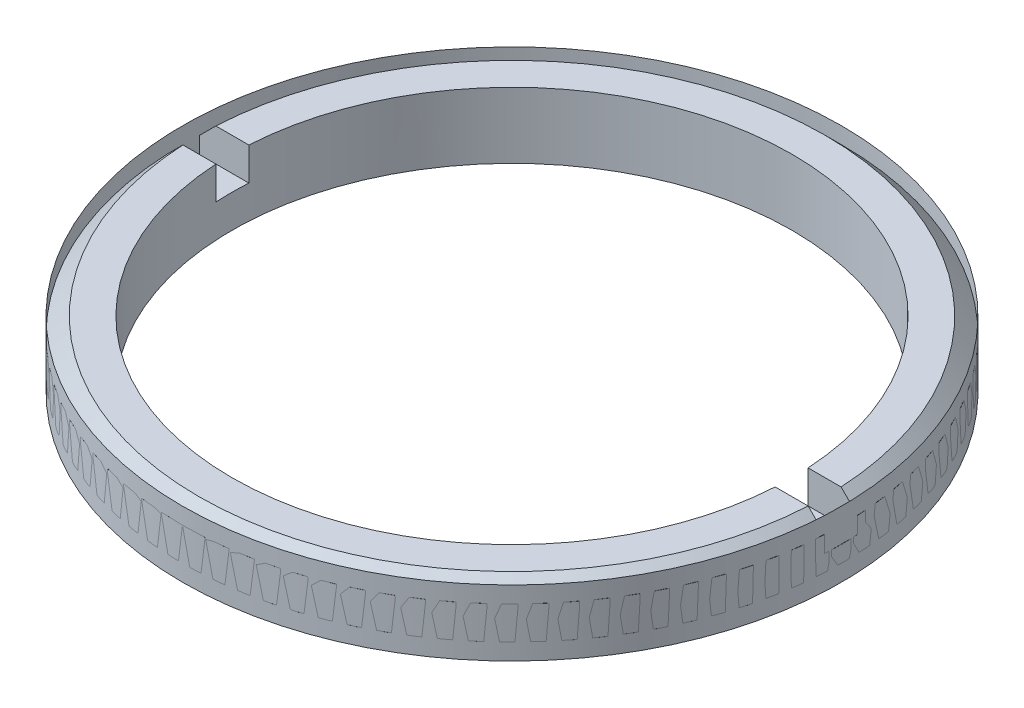
ISO-10303-21;
HEADER;
FILE_DESCRIPTION(('STEP AP214'),'2;1');
FILE_NAME('part.step','',(''),(''),'','','');
FILE_SCHEMA(('AUTOMOTIVE_DESIGN { 1 0 10303 214 1 1 1 1 }'));
ENDSEC;
DATA;
#1=APPLICATION_CONTEXT('core data for automotive mechanical design processes');
#2=APPLICATION_PROTOCOL_DEFINITION('international standard','automotive_design',2000,#1);
#3=PRODUCT_CONTEXT('',#1,'mechanical');
#4=PRODUCT('Part','Part','',(#3));
#5=PRODUCT_RELATED_PRODUCT_CATEGORY('part','',(#4));
#6=PRODUCT_DEFINITION_FORMATION('','',#4);
#7=PRODUCT_DEFINITION_CONTEXT('part definition',#1,'design');
#8=PRODUCT_DEFINITION('design','',#6,#7);
#9=PRODUCT_DEFINITION_SHAPE('','',#8);
#10=(LENGTH_UNIT() NAMED_UNIT(*) SI_UNIT(.MILLI.,.METRE.));
#11=(NAMED_UNIT(*) PLANE_ANGLE_UNIT() SI_UNIT($,.RADIAN.));
#12=(NAMED_UNIT(*) SI_UNIT($,.STERADIAN.) SOLID_ANGLE_UNIT());
#13=UNCERTAINTY_MEASURE_WITH_UNIT(LENGTH_MEASURE(1.E-05),#10,'distance_accuracy_value','');
#14=(GEOMETRIC_REPRESENTATION_CONTEXT(3) GLOBAL_UNCERTAINTY_ASSIGNED_CONTEXT((#13)) GLOBAL_UNIT_ASSIGNED_CONTEXT((#10,
#11,#12)) REPRESENTATION_CONTEXT('',''));
#15=CARTESIAN_POINT('',(0.,0.,0.));
#16=DIRECTION('',(0.,0.,1.));
#17=DIRECTION('',(1.,0.,0.));
#18=AXIS2_PLACEMENT_3D('',#15,#16,#17);
#19=CARTESIAN_POINT('',(0.,2.99999999999901,0.));
#20=DIRECTION('',(0.,-1.,0.));
#21=DIRECTION('',(1.,0.,0.));
#22=AXIS2_PLACEMENT_3D('',#19,#20,#21);
#23=CONICAL_SURFACE('',#22,20.0000000000008,0.7853981633973);
#24=CARTESIAN_POINT('',(0.,3.,0.));
#25=DIRECTION('',(0.,1.,0.));
#26=DIRECTION('',(0.,0.,1.));
#27=AXIS2_PLACEMENT_3D('',#24,#25,#26);
#28=CIRCLE('',#27,20.);
#29=CARTESIAN_POINT('',(19.9749843554391,3.,1.));
#30=VERTEX_POINT('',#29);
#31=CARTESIAN_POINT('',(-19.9749843554394,2.99999999999962,1.));
#32=VERTEX_POINT('',#31);
#33=EDGE_CURVE('P0_E99',#30,#32,#28,.F.);
#34=ORIENTED_EDGE('',*,*,#33,.F.);
#35=CARTESIAN_POINT('',(19.9749843554389,2.99999999999918,1.));
#36=CARTESIAN_POINT('',(19.808103594242,3.16667231197109,1.));
#37=CARTESIAN_POINT('',(19.6412200141085,3.33334180128986,1.));
#38=CARTESIAN_POINT('',(19.3074472159656,3.66667513462354,1.));
#39=CARTESIAN_POINT('',(19.1405579979562,3.83333897863845,1.));
#40=CARTESIAN_POINT('',(18.9736659610102,4.00000000000021,1.));
#41=B_SPLINE_CURVE_WITH_KNOTS('',3,(#35,#36,#37,#38,#39,#40),.UNSPECIFIED.,.F.,.F.,(4,2,4),(0.,
0.707573057635525,1.41514611528143),.UNSPECIFIED.);
#42=CARTESIAN_POINT('',(18.9736659610102,4.00000000000021,1.));
#43=VERTEX_POINT('',#42);
#44=EDGE_CURVE('P0_E129',#30,#43,#41,.T.);
#45=ORIENTED_EDGE('',*,*,#44,.T.);
#46=CARTESIAN_POINT('',(0.,4.00000000000021,0.));
#47=DIRECTION('',(0.,-1.,0.));
#48=DIRECTION('',(1.,0.,0.));
#49=AXIS2_PLACEMENT_3D('',#46,#47,#48);
#50=CIRCLE('',#49,18.9999999999999);
#51=CARTESIAN_POINT('',(-18.9736659610102,4.00000000000021,1.));
#52=VERTEX_POINT('',#51);
#53=EDGE_CURVE('P0_E101',#52,#43,#50,.F.);
#54=ORIENTED_EDGE('',*,*,#53,.F.);
#55=CARTESIAN_POINT('',(-18.9736659610102,4.00000000000021,1.));
#56=CARTESIAN_POINT('',(-19.1405579979562,3.83333897863846,1.));
#57=CARTESIAN_POINT('',(-19.3074472159656,3.66667513462356,1.));
#58=CARTESIAN_POINT('',(-19.6412200141084,3.3333418012899,1.));
#59=CARTESIAN_POINT('',(-19.8081035942419,3.16667231197115,1.));
#60=CARTESIAN_POINT('',(-19.9749843554388,2.99999999999924,1.));
#61=B_SPLINE_CURVE_WITH_KNOTS('',3,(#55,#56,#57,#58,#59,#60),.UNSPECIFIED.,.F.,.F.,(4,2,4),(0.,
0.70757305764586,1.41514611528134),.UNSPECIFIED.);
#62=EDGE_CURVE('P0_E20',#52,#32,#61,.T.);
#63=ORIENTED_EDGE('',*,*,#62,.T.);
#64=EDGE_LOOP('',(#34,#45,#54,#63));
#65=FACE_BOUND('',#64,.T.);
#66=ADVANCED_FACE('P0_F16',(#65),#23,.T.);
#67=CARTESIAN_POINT('',(0.,2.,0.));
#68=DIRECTION('',(0.,1.,0.));
#69=DIRECTION('',(0.,0.,1.));
#70=AXIS2_PLACEMENT_3D('',#67,#68,#69);
#71=PLANE('',#70);
#72=DIRECTION('',(-1.,0.,0.));
#73=VECTOR('',#72,1.);
#74=CARTESIAN_POINT('',(24.77920463578,2.,-1.));
#75=LINE('',#74,#73);
#76=CARTESIAN_POINT('',(-16.9705627484771,2.,-0.999999999999919));
#77=VERTEX_POINT('',#76);
#78=CARTESIAN_POINT('',(-19.9749843554391,2.,-1.));
#79=VERTEX_POINT('',#78);
#80=EDGE_CURVE('P0_E121',#77,#79,#75,.T.);
#81=ORIENTED_EDGE('',*,*,#80,.T.);
#82=CARTESIAN_POINT('',(0.,2.,0.));
#83=DIRECTION('',(0.,1.,0.));
#84=DIRECTION('',(0.,0.,1.));
#85=AXIS2_PLACEMENT_3D('',#82,#83,#84);
#86=CIRCLE('',#85,20.);
#87=CARTESIAN_POINT('',(-19.9749843554391,2.,1.));
#88=VERTEX_POINT('',#87);
#89=EDGE_CURVE('P0_E111',#88,#79,#86,.F.);
#90=ORIENTED_EDGE('',*,*,#89,.F.);
#91=DIRECTION('',(1.,0.,0.));
#92=VECTOR('',#91,1.);
#93=CARTESIAN_POINT('',(-22.38978133162,2.,1.));
#94=LINE('',#93,#92);
#95=CARTESIAN_POINT('',(-16.9705627484771,2.,0.999999999999916));
#96=VERTEX_POINT('',#95);
#97=EDGE_CURVE('P0_E118',#88,#96,#94,.T.);
#98=ORIENTED_EDGE('',*,*,#97,.T.);
#99=CARTESIAN_POINT('',(0.,2.,0.));
#100=DIRECTION('',(0.,1.,0.));
#101=DIRECTION('',(0.,0.,1.));
#102=AXIS2_PLACEMENT_3D('',#99,#100,#101);
#103=CIRCLE('',#102,17.);
#104=EDGE_CURVE('P0_E103',#96,#77,#103,.F.);
#105=ORIENTED_EDGE('',*,*,#104,.T.);
#106=EDGE_LOOP('',(#81,#90,#98,#105));
#107=FACE_BOUND('',#106,.T.);
#108=ADVANCED_FACE('P0_F164',(#107),#71,.T.);
#109=CARTESIAN_POINT('',(0.,2.99999999999901,0.));
#110=DIRECTION('',(0.,-1.,0.));
#111=DIRECTION('',(0.,0.,-1.));
#112=AXIS2_PLACEMENT_3D('',#109,#110,#111);
#113=CONICAL_SURFACE('',#112,20.0000000000008,0.7853981633973);
#114=CARTESIAN_POINT('',(0.,3.,0.));
#115=DIRECTION('',(0.,1.,0.));
#116=DIRECTION('',(0.,0.,1.));
#117=AXIS2_PLACEMENT_3D('',#114,#115,#116);
#118=CIRCLE('',#117,20.);
#119=CARTESIAN_POINT('',(-19.9749843554391,3.,-1.));
#120=VERTEX_POINT('',#119);
#121=CARTESIAN_POINT('',(19.9749843554394,2.99999999999962,-1.));
#122=VERTEX_POINT('',#121);
#123=EDGE_CURVE('P0_E222',#120,#122,#118,.F.);
#124=ORIENTED_EDGE('',*,*,#123,.F.);
#125=CARTESIAN_POINT('',(-19.9749843554389,2.99999999999918,-1.));
#126=CARTESIAN_POINT('',(-19.808103594242,3.16667231197109,-1.));
#127=CARTESIAN_POINT('',(-19.6412200141085,3.33334180128986,-1.));
#128=CARTESIAN_POINT('',(-19.3074472159656,3.66667513462354,-1.));
#129=CARTESIAN_POINT('',(-19.1405579979562,3.83333897863845,-1.));
#130=CARTESIAN_POINT('',(-18.9736659610102,4.00000000000022,-1.));
#131=B_SPLINE_CURVE_WITH_KNOTS('',3,(#125,#126,#127,#128,#129,#130),.UNSPECIFIED.,.F.,.F.,(4,2,
4),(0.,0.707573057635524,1.41514611528143),.UNSPECIFIED.);
#132=CARTESIAN_POINT('',(-18.9736659610102,4.00000000000021,-1.));
#133=VERTEX_POINT('',#132);
#134=EDGE_CURVE('P0_E147',#120,#133,#131,.T.);
#135=ORIENTED_EDGE('',*,*,#134,.T.);
#136=CARTESIAN_POINT('',(0.,4.00000000000021,0.));
#137=DIRECTION('',(0.,-1.,0.));
#138=DIRECTION('',(0.,0.,-1.));
#139=AXIS2_PLACEMENT_3D('',#136,#137,#138);
#140=CIRCLE('',#139,18.9999999999999);
#141=CARTESIAN_POINT('',(18.9736659610102,4.00000000000021,-1.));
#142=VERTEX_POINT('',#141);
#143=EDGE_CURVE('P0_E144',#142,#133,#140,.F.);
#144=ORIENTED_EDGE('',*,*,#143,.F.);
#145=CARTESIAN_POINT('',(18.9736659610102,4.00000000000021,-1.));
#146=CARTESIAN_POINT('',(19.1405579979562,3.83333897863846,-1.));
#147=CARTESIAN_POINT('',(19.3074472159656,3.66667513462356,-1.));
#148=CARTESIAN_POINT('',(19.6412200141084,3.3333418012899,-1.));
#149=CARTESIAN_POINT('',(19.8081035942419,3.16667231197114,-1.));
#150=CARTESIAN_POINT('',(19.9749843554388,2.99999999999924,-1.));
#151=B_SPLINE_CURVE_WITH_KNOTS('',3,(#145,#146,#147,#148,#149,#150),.UNSPECIFIED.,.F.,.F.,(4,2,
4),(0.,0.707573057645861,1.41514611528134),.UNSPECIFIED.);
#152=EDGE_CURVE('P0_E169',#142,#122,#151,.T.);
#153=ORIENTED_EDGE('',*,*,#152,.T.);
#154=EDGE_LOOP('',(#124,#135,#144,#153));
#155=FACE_BOUND('',#154,.T.);
#156=ADVANCED_FACE('P0_F159',(#155),#113,.T.);
#157=CARTESIAN_POINT('',(0.,2.,0.));
#158=DIRECTION('',(0.,1.,0.));
#159=DIRECTION('',(0.,0.,1.));
#160=AXIS2_PLACEMENT_3D('',#157,#158,#159);
#161=PLANE('',#160);
#162=CARTESIAN_POINT('',(0.,2.,0.));
#163=DIRECTION('',(0.,1.,0.));
#164=DIRECTION('',(0.,0.,1.));
#165=AXIS2_PLACEMENT_3D('',#162,#163,#164);
#166=CIRCLE('',#165,20.);
#167=CARTESIAN_POINT('',(19.9749843554391,2.,-1.));
#168=VERTEX_POINT('',#167);
#169=CARTESIAN_POINT('',(19.9749843554391,2.,1.));
#170=VERTEX_POINT('',#169);
#171=EDGE_CURVE('P0_E112',#168,#170,#166,.F.);
#172=ORIENTED_EDGE('',*,*,#171,.F.);
#173=DIRECTION('',(-1.,0.,0.));
#174=VECTOR('',#173,1.);
#175=CARTESIAN_POINT('',(24.77920463578,2.,-1.));
#176=LINE('',#175,#174);
#177=CARTESIAN_POINT('',(16.9705627484771,2.,-0.999999999999917));
#178=VERTEX_POINT('',#177);
#179=EDGE_CURVE('P0_E212',#168,#178,#176,.T.);
#180=ORIENTED_EDGE('',*,*,#179,.T.);
#181=CARTESIAN_POINT('',(0.,2.,0.));
#182=DIRECTION('',(0.,1.,0.));
#183=DIRECTION('',(0.,0.,1.));
#184=AXIS2_PLACEMENT_3D('',#181,#182,#183);
#185=CIRCLE('',#184,17.);
#186=CARTESIAN_POINT('',(16.9705627484771,2.,0.999999999999916));
#187=VERTEX_POINT('',#186);
#188=EDGE_CURVE('P0_E175',#178,#187,#185,.F.);
#189=ORIENTED_EDGE('',*,*,#188,.T.);
#190=DIRECTION('',(1.,0.,0.));
#191=VECTOR('',#190,1.);
#192=CARTESIAN_POINT('',(-22.38978133162,2.,1.));
#193=LINE('',#192,#191);
#194=EDGE_CURVE('P0_E130',#187,#170,#193,.T.);
#195=ORIENTED_EDGE('',*,*,#194,.T.);
#196=EDGE_LOOP('',(#172,#180,#189,#195));
#197=FACE_BOUND('',#196,.T.);
#198=ADVANCED_FACE('P0_F163',(#197),#161,.T.);
#199=CARTESIAN_POINT('',(0.,0.,0.));
#200=DIRECTION('',(0.,1.,0.));
#201=DIRECTION('',(0.,0.,1.));
#202=AXIS2_PLACEMENT_3D('',#199,#200,#201);
#203=CYLINDRICAL_SURFACE('',#202,20.);
#204=CARTESIAN_POINT('',(0.,1.00000000000023,0.));
#205=DIRECTION('',(0.,1.,0.));
#206=DIRECTION('',(0.,0.,-1.));
#207=AXIS2_PLACEMENT_3D('',#204,#205,#206);
#208=CIRCLE('',#207,19.9999999999998);
#209=CARTESIAN_POINT('',(0.,1.00000000000023,-19.9999999999998));
#210=VERTEX_POINT('',#209);
#211=EDGE_CURVE('P0_E210',#210,#210,#208,.F.);
#212=ORIENTED_EDGE('',*,*,#211,.F.);
#213=EDGE_LOOP('',(#212));
#214=FACE_BOUND('',#213,.T.);
#215=DIRECTION('',(0.,1.,0.));
#216=VECTOR('',#215,1.);
#217=CARTESIAN_POINT('',(-19.97498435544,4.,1.));
#218=LINE('',#217,#216);
#219=EDGE_CURVE('P0_E108',#32,#88,#218,.F.);
#220=ORIENTED_EDGE('',*,*,#219,.T.);
#221=ORIENTED_EDGE('',*,*,#89,.T.);
#222=DIRECTION('',(0.,1.,0.));
#223=VECTOR('',#222,1.);
#224=CARTESIAN_POINT('',(-19.97498435544,4.,-1.));
#225=LINE('',#224,#223);
#226=EDGE_CURVE('P0_E126',#79,#120,#225,.T.);
#227=ORIENTED_EDGE('',*,*,#226,.T.);
#228=ORIENTED_EDGE('',*,*,#123,.T.);
#229=DIRECTION('',(0.,1.,0.));
#230=VECTOR('',#229,1.);
#231=CARTESIAN_POINT('',(19.97498435544,4.,-1.));
#232=LINE('',#231,#230);
#233=EDGE_CURVE('P0_E217',#122,#168,#232,.F.);
#234=ORIENTED_EDGE('',*,*,#233,.T.);
#235=ORIENTED_EDGE('',*,*,#171,.T.);
#236=DIRECTION('',(0.,1.,0.));
#237=VECTOR('',#236,1.);
#238=CARTESIAN_POINT('',(19.97498435544,4.,1.));
#239=LINE('',#238,#237);
#240=EDGE_CURVE('P0_E110',#170,#30,#239,.T.);
#241=ORIENTED_EDGE('',*,*,#240,.T.);
#242=ORIENTED_EDGE('',*,*,#33,.T.);
#243=EDGE_LOOP('',(#220,#221,#227,#228,#234,#235,#241,#242));
#244=FACE_BOUND('',#243,.T.);
#245=ADVANCED_FACE('P0_F107',(#214,#244),#203,.T.);
#246=CARTESIAN_POINT('',(-22.38978133162,4.,1.));
#247=DIRECTION('',(0.,0.,1.));
#248=DIRECTION('',(1.,0.,0.));
#249=AXIS2_PLACEMENT_3D('',#246,#247,#248);
#250=PLANE('',#249);
#251=ORIENTED_EDGE('',*,*,#240,.F.);
#252=ORIENTED_EDGE('',*,*,#194,.F.);
#253=DIRECTION('',(0.,1.,0.));
#254=VECTOR('',#253,1.);
#255=CARTESIAN_POINT('',(16.9705627484772,0.,0.999999999999832));
#256=LINE('',#255,#254);
#257=CARTESIAN_POINT('',(16.9705627484771,4.,0.999999999999916));
#258=VERTEX_POINT('',#257);
#259=EDGE_CURVE('P0_E143',#187,#258,#256,.T.);
#260=ORIENTED_EDGE('',*,*,#259,.T.);
#261=DIRECTION('',(1.,0.,0.));
#262=VECTOR('',#261,1.);
#263=CARTESIAN_POINT('',(0.,4.,1.));
#264=LINE('',#263,#262);
#265=EDGE_CURVE('P0_E123',#43,#258,#264,.F.);
#266=ORIENTED_EDGE('',*,*,#265,.F.);
#267=ORIENTED_EDGE('',*,*,#44,.F.);
#268=EDGE_LOOP('',(#251,#252,#260,#266,#267));
#269=FACE_BOUND('',#268,.T.);
#270=ADVANCED_FACE('P0_F233',(#269),#250,.F.);
#271=CARTESIAN_POINT('',(0.,4.,0.));
#272=DIRECTION('',(0.,1.,0.));
#273=DIRECTION('',(0.,0.,1.));
#274=AXIS2_PLACEMENT_3D('',#271,#272,#273);
#275=PLANE('',#274);
#276=CARTESIAN_POINT('',(0.,4.,0.));
#277=DIRECTION('',(0.,1.,0.));
#278=DIRECTION('',(0.,0.,1.));
#279=AXIS2_PLACEMENT_3D('',#276,#277,#278);
#280=CIRCLE('',#279,17.);
#281=CARTESIAN_POINT('',(-16.9705627484771,4.,0.999999999999916));
#282=VERTEX_POINT('',#281);
#283=EDGE_CURVE('P0_E139',#258,#282,#280,.F.);
#284=ORIENTED_EDGE('',*,*,#283,.T.);
#285=DIRECTION('',(1.,0.,0.));
#286=VECTOR('',#285,1.);
#287=CARTESIAN_POINT('',(-22.38978133162,4.,1.));
#288=LINE('',#287,#286);
#289=EDGE_CURVE('P0_E119',#282,#52,#288,.F.);
#290=ORIENTED_EDGE('',*,*,#289,.T.);
#291=ORIENTED_EDGE('',*,*,#53,.T.);
#292=ORIENTED_EDGE('',*,*,#265,.T.);
#293=EDGE_LOOP('',(#284,#290,#291,#292));
#294=FACE_BOUND('',#293,.T.);
#295=ADVANCED_FACE('P0_F239',(#294),#275,.T.);
#296=CARTESIAN_POINT('',(-22.38978133162,4.,1.));
#297=DIRECTION('',(0.,0.,1.));
#298=DIRECTION('',(1.,0.,0.));
#299=AXIS2_PLACEMENT_3D('',#296,#297,#298);
#300=PLANE('',#299);
#301=ORIENTED_EDGE('',*,*,#97,.F.);
#302=ORIENTED_EDGE('',*,*,#219,.F.);
#303=ORIENTED_EDGE('',*,*,#62,.F.);
#304=ORIENTED_EDGE('',*,*,#289,.F.);
#305=DIRECTION('',(0.,1.,0.));
#306=VECTOR('',#305,1.);
#307=CARTESIAN_POINT('',(-16.9705627484772,0.,0.999999999999832));
#308=LINE('',#307,#306);
#309=EDGE_CURVE('P0_E142',#282,#96,#308,.F.);
#310=ORIENTED_EDGE('',*,*,#309,.T.);
#311=EDGE_LOOP('',(#301,#302,#303,#304,#310));
#312=FACE_BOUND('',#311,.T.);
#313=ADVANCED_FACE('P0_F115',(#312),#300,.F.);
#314=CARTESIAN_POINT('',(24.77920463578,4.,-1.));
#315=DIRECTION('',(0.,0.,-1.));
#316=DIRECTION('',(-1.,0.,0.));
#317=AXIS2_PLACEMENT_3D('',#314,#315,#316);
#318=PLANE('',#317);
#319=ORIENTED_EDGE('',*,*,#226,.F.);
#320=ORIENTED_EDGE('',*,*,#80,.F.);
#321=DIRECTION('',(0.,1.,0.));
#322=VECTOR('',#321,1.);
#323=CARTESIAN_POINT('',(-16.9705627484771,0.,-0.999999999999838));
#324=LINE('',#323,#322);
#325=CARTESIAN_POINT('',(-16.9705627484771,4.,-0.999999999999919));
#326=VERTEX_POINT('',#325);
#327=EDGE_CURVE('P0_E138',#77,#326,#324,.T.);
#328=ORIENTED_EDGE('',*,*,#327,.T.);
#329=DIRECTION('',(1.,0.,0.));
#330=VECTOR('',#329,1.);
#331=CARTESIAN_POINT('',(0.,4.,-1.));
#332=LINE('',#331,#330);
#333=EDGE_CURVE('P0_E146',#133,#326,#332,.T.);
#334=ORIENTED_EDGE('',*,*,#333,.F.);
#335=ORIENTED_EDGE('',*,*,#134,.F.);
#336=EDGE_LOOP('',(#319,#320,#328,#334,#335));
#337=FACE_BOUND('',#336,.T.);
#338=ADVANCED_FACE('P0_F156',(#337),#318,.F.);
#339=CARTESIAN_POINT('',(0.,4.,0.));
#340=DIRECTION('',(0.,1.,0.));
#341=DIRECTION('',(0.,0.,1.));
#342=AXIS2_PLACEMENT_3D('',#339,#340,#341);
#343=PLANE('',#342);
#344=ORIENTED_EDGE('',*,*,#143,.T.);
#345=ORIENTED_EDGE('',*,*,#333,.T.);
#346=CARTESIAN_POINT('',(0.,4.,0.));
#347=DIRECTION('',(0.,1.,0.));
#348=DIRECTION('',(0.,0.,1.));
#349=AXIS2_PLACEMENT_3D('',#346,#347,#348);
#350=CIRCLE('',#349,17.);
#351=CARTESIAN_POINT('',(16.9705627484771,4.,-0.999999999999917));
#352=VERTEX_POINT('',#351);
#353=EDGE_CURVE('P0_E135',#326,#352,#350,.F.);
#354=ORIENTED_EDGE('',*,*,#353,.T.);
#355=DIRECTION('',(-1.,0.,0.));
#356=VECTOR('',#355,1.);
#357=CARTESIAN_POINT('',(24.77920463578,4.,-1.));
#358=LINE('',#357,#356);
#359=EDGE_CURVE('P0_E39',#352,#142,#358,.F.);
#360=ORIENTED_EDGE('',*,*,#359,.T.);
#361=EDGE_LOOP('',(#344,#345,#354,#360));
#362=FACE_BOUND('',#361,.T.);
#363=ADVANCED_FACE('P0_F182',(#362),#343,.T.);
#364=CARTESIAN_POINT('',(24.77920463578,4.,-1.));
#365=DIRECTION('',(0.,0.,-1.));
#366=DIRECTION('',(-1.,0.,0.));
#367=AXIS2_PLACEMENT_3D('',#364,#365,#366);
#368=PLANE('',#367);
#369=ORIENTED_EDGE('',*,*,#179,.F.);
#370=ORIENTED_EDGE('',*,*,#233,.F.);
#371=ORIENTED_EDGE('',*,*,#152,.F.);
#372=ORIENTED_EDGE('',*,*,#359,.F.);
#373=DIRECTION('',(0.,1.,0.));
#374=VECTOR('',#373,1.);
#375=CARTESIAN_POINT('',(16.9705627484772,0.,-0.999999999999834));
#376=LINE('',#375,#374);
#377=EDGE_CURVE('P0_E134',#352,#178,#376,.F.);
#378=ORIENTED_EDGE('',*,*,#377,.T.);
#379=EDGE_LOOP('',(#369,#370,#371,#372,#378));
#380=FACE_BOUND('',#379,.T.);
#381=ADVANCED_FACE('P0_F177',(#380),#368,.F.);
#382=CARTESIAN_POINT('',(0.,1.00000000000023,0.));
#383=DIRECTION('',(0.,1.,0.));
#384=DIRECTION('',(-1.,0.,0.));
#385=AXIS2_PLACEMENT_3D('',#382,#383,#384);
#386=CONICAL_SURFACE('',#385,19.9999999999998,0.785398163397302);
#387=ORIENTED_EDGE('',*,*,#211,.T.);
#388=EDGE_LOOP('',(#387));
#389=FACE_BOUND('',#388,.T.);
#390=CARTESIAN_POINT('',(0.,0.,0.));
#391=DIRECTION('',(0.,1.,0.));
#392=DIRECTION('',(-1.,0.,0.));
#393=AXIS2_PLACEMENT_3D('',#390,#391,#392);
#394=CIRCLE('',#393,18.9999999999999);
#395=CARTESIAN_POINT('',(-18.9999999999999,0.,0.));
#396=VERTEX_POINT('',#395);
#397=EDGE_CURVE('P0_E30',#396,#396,#394,.T.);
#398=ORIENTED_EDGE('',*,*,#397,.T.);
#399=EDGE_LOOP('',(#398));
#400=FACE_BOUND('',#399,.T.);
#401=ADVANCED_FACE('P0_F181',(#389,#400),#386,.T.);
#402=CARTESIAN_POINT('',(0.,0.,0.));
#403=DIRECTION('',(0.,1.,0.));
#404=DIRECTION('',(0.,0.,1.));
#405=AXIS2_PLACEMENT_3D('',#402,#403,#404);
#406=CYLINDRICAL_SURFACE('',#405,17.);
#407=CARTESIAN_POINT('',(0.,0.,0.));
#408=DIRECTION('',(0.,1.,0.));
#409=DIRECTION('',(0.,0.,1.));
#410=AXIS2_PLACEMENT_3D('',#407,#408,#409);
#411=CIRCLE('',#410,17.);
#412=CARTESIAN_POINT('',(0.,0.,17.));
#413=VERTEX_POINT('',#412);
#414=EDGE_CURVE('P0_E11',#413,#413,#411,.F.);
#415=ORIENTED_EDGE('',*,*,#414,.T.);
#416=EDGE_LOOP('',(#415));
#417=FACE_BOUND('',#416,.T.);
#418=ORIENTED_EDGE('',*,*,#353,.F.);
#419=ORIENTED_EDGE('',*,*,#327,.F.);
#420=ORIENTED_EDGE('',*,*,#104,.F.);
#421=ORIENTED_EDGE('',*,*,#309,.F.);
#422=ORIENTED_EDGE('',*,*,#283,.F.);
#423=ORIENTED_EDGE('',*,*,#259,.F.);
#424=ORIENTED_EDGE('',*,*,#188,.F.);
#425=ORIENTED_EDGE('',*,*,#377,.F.);
#426=EDGE_LOOP('',(#418,#419,#420,#421,#422,#423,#424,#425));
#427=FACE_BOUND('',#426,.T.);
#428=ADVANCED_FACE('P0_F193',(#417,#427),#406,.F.);
#429=CARTESIAN_POINT('',(0.,0.,0.));
#430=DIRECTION('',(0.,1.,0.));
#431=DIRECTION('',(0.,0.,1.));
#432=AXIS2_PLACEMENT_3D('',#429,#430,#431);
#433=PLANE('',#432);
#434=ORIENTED_EDGE('',*,*,#414,.F.);
#435=EDGE_LOOP('',(#434));
#436=FACE_BOUND('',#435,.T.);
#437=ORIENTED_EDGE('',*,*,#397,.F.);
#438=EDGE_LOOP('',(#437));
#439=FACE_BOUND('',#438,.T.);
#440=ADVANCED_FACE('P0_F191',(#436,#439),#433,.F.);
#441=CLOSED_SHELL('',(#66,#108,#156,#198,#245,#270,#295,#313,#338,#363,#381,#401,#428,#440));
#442=MANIFOLD_SOLID_BREP('P0_B1',#441);
#443=CARTESIAN_POINT('',(0.,4.,0.));
#444=DIRECTION('',(0.,1.,0.));
#445=DIRECTION('',(0.,0.,1.));
#446=AXIS2_PLACEMENT_3D('',#443,#444,#445);
#447=CYLINDRICAL_SURFACE('',#446,20.);
#448=CARTESIAN_POINT('',(0.,0.,0.));
#449=DIRECTION('',(0.,1.,0.));
#450=DIRECTION('',(0.,0.,1.));
#451=AXIS2_PLACEMENT_3D('',#448,#449,#450);
#452=CIRCLE('',#451,20.);
#453=CARTESIAN_POINT('',(0.,0.,20.));
#454=VERTEX_POINT('',#453);
#455=EDGE_CURVE('P1_E20',#454,#454,#452,.T.);
#456=ORIENTED_EDGE('',*,*,#455,.T.);
#457=EDGE_LOOP('',(#456));
#458=FACE_BOUND('',#457,.T.);
#459=CARTESIAN_POINT('',(0.,4.,0.));
#460=DIRECTION('',(0.,1.,0.));
#461=DIRECTION('',(0.,0.,1.));
#462=AXIS2_PLACEMENT_3D('',#459,#460,#461);
#463=CIRCLE('',#462,20.);
#464=CARTESIAN_POINT('',(0.,4.,20.));
#465=VERTEX_POINT('',#464);
#466=EDGE_CURVE('P1_E11',#465,#465,#463,.F.);
#467=ORIENTED_EDGE('',*,*,#466,.T.);
#468=EDGE_LOOP('',(#467));
#469=FACE_BOUND('',#468,.T.);
#470=ADVANCED_FACE('P1_F16',(#458,#469),#447,.T.);
#471=CARTESIAN_POINT('',(0.,0.,0.));
#472=DIRECTION('',(0.,1.,0.));
#473=DIRECTION('',(0.,0.,1.));
#474=AXIS2_PLACEMENT_3D('',#471,#472,#473);
#475=PLANE('',#474);
#476=CARTESIAN_POINT('',(19.,0.,0.));
#477=CARTESIAN_POINT('',(18.9985409819028,0.,1.87807238292808));
#478=CARTESIAN_POINT('',(18.6349923098426,0.,3.70587741485853));
#479=CARTESIAN_POINT('',(18.2696886426084,0.,5.5425059943805));
#480=CARTESIAN_POINT('',(17.5536880730321,0.,7.27109281581782));
#481=CARTESIAN_POINT('',(16.8377148878009,0.,8.9996135252712));
#482=CARTESIAN_POINT('',(15.7979187178078,0.,10.5558410434913));
#483=CARTESIAN_POINT('',(14.7586161375189,0.,12.11132982281));
#484=CARTESIAN_POINT('',(13.4350146507483,0.,13.435010209926));
#485=CARTESIAN_POINT('',(12.1122723451509,0.,14.7578313646528));
#486=CARTESIAN_POINT('',(10.5558316325608,0.,15.7979199925948));
#487=CARTESIAN_POINT('',(9.00037973577387,0.,16.8373478462049));
#488=CARTESIAN_POINT('',(7.27098160776479,0.,17.5537000976509));
#489=CARTESIAN_POINT('',(5.54256102051372,0.,18.2696474316222));
#490=CARTESIAN_POINT('',(3.70671195955224,0.,18.6349026095078));
#491=CARTESIAN_POINT('',(1.87192696250089,0.,18.9999460843395));
#492=CARTESIAN_POINT('',(0.,0.,19.));
#493=CARTESIAN_POINT('',(-1.87083387870247,0.,19.0000538841773));
#494=CARTESIAN_POINT('',(-3.70671195955224,0.,18.6349026095078));
#495=CARTESIAN_POINT('',(-5.54151065299857,0.,18.2699660221263));
#496=CARTESIAN_POINT('',(-7.27098160776479,0.,17.5537000976509));
#497=CARTESIAN_POINT('',(-8.99941146806084,0.,16.8378653457784));
#498=CARTESIAN_POINT('',(-10.5558316325608,0.,15.7979199925948));
#499=CARTESIAN_POINT('',(-12.1114237685412,0.,14.7585278990199));
#500=CARTESIAN_POINT('',(-13.4350146507483,0.,13.435010209926));
#501=CARTESIAN_POINT('',(-14.7579195170052,0.,12.1121784988464));
#502=CARTESIAN_POINT('',(-15.7979187178079,0.,10.5558410434913));
#503=CARTESIAN_POINT('',(-16.8371970506205,0.,9.00058235228557));
#504=CARTESIAN_POINT('',(-17.5536880730321,0.,7.27109281581795));
#505=CARTESIAN_POINT('',(-18.2693703425223,0.,5.54355547368537));
#506=CARTESIAN_POINT('',(-18.6349923098424,0.,3.70587741485931));
#507=CARTESIAN_POINT('',(-18.9985405547378,0.,1.87862223687856));
#508=CARTESIAN_POINT('',(-19.,0.,0.));
#509=B_SPLINE_CURVE_WITH_KNOTS('',2,(#476,#477,#478,#479,#480,#481,#482,#483,#484,#485,#486,
#487,#488,#489,#490,#491,#492,#493,#494,#495,#496,#497,#498,#499,#500,#501,#502,#503,#504,#505,
#506,#507,#508),.UNSPECIFIED.,.F.,.F.,(3,2,2,2,2,2,2,2,2,2,2,2,2,2,2,2,3),(0.,0.0625,0.125,
0.1875,0.25,0.3125,0.375,0.4375,0.5,0.5625,0.625,0.6875,0.75,0.8125,0.875,0.9375,1.),.UNSPECIFIED.);
#510=CARTESIAN_POINT('',(19.,0.,0.));
#511=VERTEX_POINT('',#510);
#512=CARTESIAN_POINT('',(-19.,0.,0.));
#513=VERTEX_POINT('',#512);
#514=EDGE_CURVE('P1_E28',#511,#513,#509,.T.);
#515=ORIENTED_EDGE('',*,*,#514,.F.);
#516=CARTESIAN_POINT('',(-19.,0.,0.));
#517=CARTESIAN_POINT('',(-18.9985409819028,0.,-1.87807238292808));
#518=CARTESIAN_POINT('',(-18.6349923098426,0.,-3.70587741485853));
#519=CARTESIAN_POINT('',(-18.2696886426084,0.,-5.5425059943805));
#520=CARTESIAN_POINT('',(-17.5536880730321,0.,-7.27109281581782));
#521=CARTESIAN_POINT('',(-16.8377148878009,0.,-8.9996135252712));
#522=CARTESIAN_POINT('',(-15.7979187178078,0.,-10.5558410434913));
#523=CARTESIAN_POINT('',(-14.7586161375189,0.,-12.11132982281));
#524=CARTESIAN_POINT('',(-13.4350146507483,0.,-13.435010209926));
#525=CARTESIAN_POINT('',(-12.1122723451509,0.,-14.7578313646528));
#526=CARTESIAN_POINT('',(-10.5558316325608,0.,-15.7979199925948));
#527=CARTESIAN_POINT('',(-9.00037973577387,0.,-16.8373478462049));
#528=CARTESIAN_POINT('',(-7.27098160776479,0.,-17.5537000976509));
#529=CARTESIAN_POINT('',(-5.54256102051372,0.,-18.2696474316222));
#530=CARTESIAN_POINT('',(-3.70671195955224,0.,-18.6349026095078));
#531=CARTESIAN_POINT('',(-1.87192696250089,0.,-18.9999460843395));
#532=CARTESIAN_POINT('',(0.,0.,-19.));
#533=CARTESIAN_POINT('',(1.87083387870247,0.,-19.0000538841773));
#534=CARTESIAN_POINT('',(3.70671195955224,0.,-18.6349026095078));
#535=CARTESIAN_POINT('',(5.54151065299857,0.,-18.2699660221263));
#536=CARTESIAN_POINT('',(7.27098160776479,0.,-17.5537000976509));
#537=CARTESIAN_POINT('',(8.99941146806084,0.,-16.8378653457784));
#538=CARTESIAN_POINT('',(10.5558316325608,0.,-15.7979199925948));
#539=CARTESIAN_POINT('',(12.1114237685412,0.,-14.7585278990199));
#540=CARTESIAN_POINT('',(13.4350146507483,0.,-13.435010209926));
#541=CARTESIAN_POINT('',(14.7579195170052,0.,-12.1121784988464));
#542=CARTESIAN_POINT('',(15.7979187178079,0.,-10.5558410434913));
#543=CARTESIAN_POINT('',(16.8371970506205,0.,-9.00058235228557));
#544=CARTESIAN_POINT('',(17.5536880730321,0.,-7.27109281581795));
#545=CARTESIAN_POINT('',(18.2693703425223,0.,-5.54355547368537));
#546=CARTESIAN_POINT('',(18.6349923098424,0.,-3.70587741485931));
#547=CARTESIAN_POINT('',(18.9985405547378,0.,-1.87862223687856));
#548=CARTESIAN_POINT('',(19.,0.,0.));
#549=B_SPLINE_CURVE_WITH_KNOTS('',2,(#516,#517,#518,#519,#520,#521,#522,#523,#524,#525,#526,
#527,#528,#529,#530,#531,#532,#533,#534,#535,#536,#537,#538,#539,#540,#541,#542,#543,#544,#545,
#546,#547,#548),.UNSPECIFIED.,.F.,.F.,(3,2,2,2,2,2,2,2,2,2,2,2,2,2,2,2,3),(0.,0.0625,0.125,
0.1875,0.25,0.3125,0.375,0.4375,0.5,0.5625,0.625,0.6875,0.75,0.8125,0.875,0.9375,1.),.UNSPECIFIED.);
#550=EDGE_CURVE('P1_E33',#513,#511,#549,.T.);
#551=ORIENTED_EDGE('',*,*,#550,.F.);
#552=EDGE_LOOP('',(#515,#551));
#553=FACE_BOUND('',#552,.T.);
#554=ORIENTED_EDGE('',*,*,#455,.F.);
#555=EDGE_LOOP('',(#554));
#556=FACE_BOUND('',#555,.T.);
#557=ADVANCED_FACE('P1_F17',(#553,#556),#475,.F.);
#558=OPEN_SHELL('',(#470,#557));
#559=SHELL_BASED_SURFACE_MODEL('P1_B1',(#558));
#560=ADVANCED_BREP_SHAPE_REPRESENTATION('',(#18,#442),#14);
#561=MANIFOLD_SURFACE_SHAPE_REPRESENTATION('',(#18,#559),#14);
#562=SHAPE_REPRESENTATION('',(#18),#14);
#563=SHAPE_DEFINITION_REPRESENTATION(#9,#562);
#564=SHAPE_REPRESENTATION_RELATIONSHIP('','',#562,#560);
#565=SHAPE_REPRESENTATION_RELATIONSHIP('','',#562,#561);
ENDSEC;
END-ISO-10303-21;
